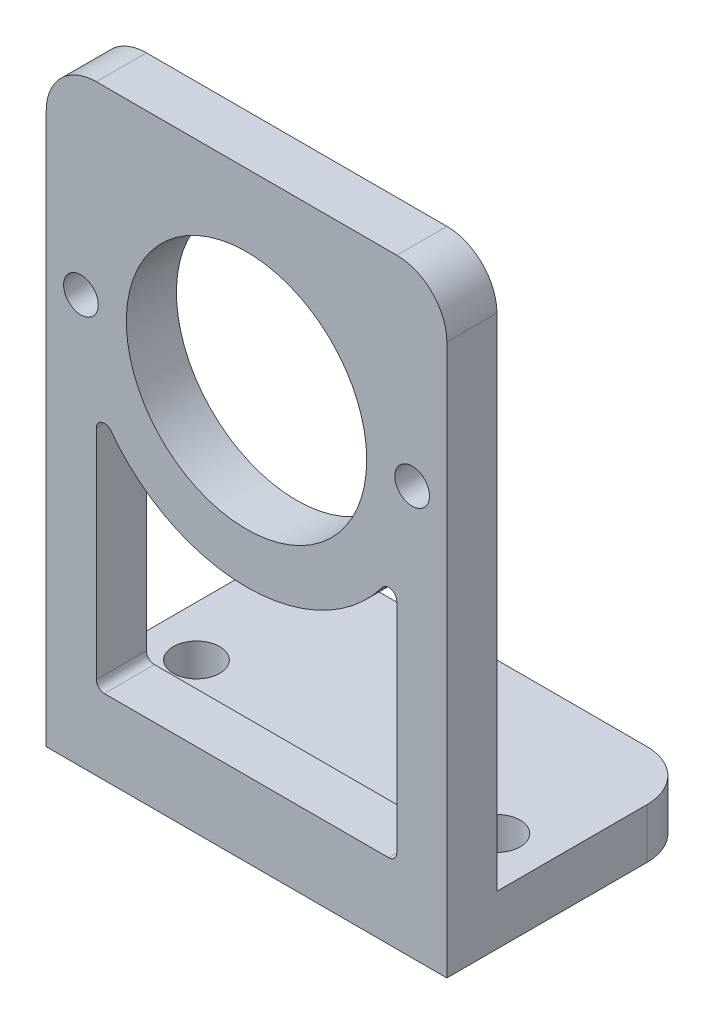
ISO-10303-21;
HEADER;
FILE_DESCRIPTION(('STEP AP214'),'2;1');
FILE_NAME('part.step','',(''),(''),'','','');
FILE_SCHEMA(('AUTOMOTIVE_DESIGN { 1 0 10303 214 1 1 1 1 }'));
ENDSEC;
DATA;
#1=APPLICATION_CONTEXT('core data for automotive mechanical design processes');
#2=APPLICATION_PROTOCOL_DEFINITION('international standard','automotive_design',2000,#1);
#3=PRODUCT_CONTEXT('',#1,'mechanical');
#4=PRODUCT('Part','Part','',(#3));
#5=PRODUCT_RELATED_PRODUCT_CATEGORY('part','',(#4));
#6=PRODUCT_DEFINITION_FORMATION('','',#4);
#7=PRODUCT_DEFINITION_CONTEXT('part definition',#1,'design');
#8=PRODUCT_DEFINITION('design','',#6,#7);
#9=PRODUCT_DEFINITION_SHAPE('','',#8);
#10=(LENGTH_UNIT() NAMED_UNIT(*) SI_UNIT(.MILLI.,.METRE.));
#11=(NAMED_UNIT(*) PLANE_ANGLE_UNIT() SI_UNIT($,.RADIAN.));
#12=(NAMED_UNIT(*) SI_UNIT($,.STERADIAN.) SOLID_ANGLE_UNIT());
#13=UNCERTAINTY_MEASURE_WITH_UNIT(LENGTH_MEASURE(1.E-05),#10,'distance_accuracy_value','');
#14=(GEOMETRIC_REPRESENTATION_CONTEXT(3) GLOBAL_UNCERTAINTY_ASSIGNED_CONTEXT((#13)) GLOBAL_UNIT_ASSIGNED_CONTEXT((#10,
#11,#12)) REPRESENTATION_CONTEXT('',''));
#15=CARTESIAN_POINT('',(0.,0.,0.));
#16=DIRECTION('',(0.,0.,1.));
#17=DIRECTION('',(1.,0.,0.));
#18=AXIS2_PLACEMENT_3D('',#15,#16,#17);
#19=CARTESIAN_POINT('',(12.7,38.1,-3.175));
#20=DIRECTION('',(0.,-1.,0.));
#21=DIRECTION('',(0.,0.,-1.));
#22=AXIS2_PLACEMENT_3D('',#19,#20,#21);
#23=PLANE('',#22);
#24=DIRECTION('',(-1.,0.,0.));
#25=VECTOR('',#24,1.);
#26=CARTESIAN_POINT('',(12.7,38.1,-3.175));
#27=LINE('',#26,#25);
#28=CARTESIAN_POINT('',(9.525,38.1,-3.175));
#29=VERTEX_POINT('',#28);
#30=CARTESIAN_POINT('',(-9.525,38.1,-3.175));
#31=VERTEX_POINT('',#30);
#32=EDGE_CURVE('E198',#29,#31,#27,.T.);
#33=ORIENTED_EDGE('',*,*,#32,.T.);
#34=DIRECTION('',(0.,0.,1.));
#35=VECTOR('',#34,1.);
#36=CARTESIAN_POINT('',(-9.525,38.1,-3.175));
#37=LINE('',#36,#35);
#38=CARTESIAN_POINT('',(-9.525,38.1,0.));
#39=VERTEX_POINT('',#38);
#40=EDGE_CURVE('E242',#31,#39,#37,.T.);
#41=ORIENTED_EDGE('',*,*,#40,.T.);
#42=DIRECTION('',(-1.,0.,0.));
#43=VECTOR('',#42,1.);
#44=CARTESIAN_POINT('',(12.7,38.1,0.));
#45=LINE('',#44,#43);
#46=CARTESIAN_POINT('',(9.525,38.1,0.));
#47=VERTEX_POINT('',#46);
#48=EDGE_CURVE('E184',#47,#39,#45,.T.);
#49=ORIENTED_EDGE('',*,*,#48,.F.);
#50=DIRECTION('',(0.,0.,1.));
#51=VECTOR('',#50,1.);
#52=CARTESIAN_POINT('',(9.525,38.1,-3.175));
#53=LINE('',#52,#51);
#54=EDGE_CURVE('E240',#47,#29,#53,.F.);
#55=ORIENTED_EDGE('',*,*,#54,.T.);
#56=EDGE_LOOP('',(#33,#41,#49,#55));
#57=FACE_BOUND('',#56,.T.);
#58=ADVANCED_FACE('F35',(#57),#23,.F.);
#59=CARTESIAN_POINT('',(12.7,38.1,0.));
#60=DIRECTION('',(0.,0.,-1.));
#61=DIRECTION('',(0.,1.,0.));
#62=AXIS2_PLACEMENT_3D('',#59,#60,#61);
#63=PLANE('',#62);
#64=DIRECTION('',(0.,-1.,0.));
#65=VECTOR('',#64,1.);
#66=CARTESIAN_POINT('',(-9.525,20.828,0.));
#67=LINE('',#66,#65);
#68=CARTESIAN_POINT('',(-9.525,19.0924648045806,0.));
#69=VERTEX_POINT('',#68);
#70=CARTESIAN_POINT('',(-9.525,5.2705,0.));
#71=VERTEX_POINT('',#70);
#72=EDGE_CURVE('E307',#69,#71,#67,.T.);
#73=ORIENTED_EDGE('',*,*,#72,.F.);
#74=CARTESIAN_POINT('',(-9.017,19.0924648045806,0.));
#75=DIRECTION('',(0.,0.,-1.));
#76=DIRECTION('',(0.,1.,0.));
#77=AXIS2_PLACEMENT_3D('',#74,#75,#76);
#78=CIRCLE('',#77,0.508);
#79=CARTESIAN_POINT('',(-8.6117415730337,19.3987809931388,0.));
#80=VERTEX_POINT('',#79);
#81=EDGE_CURVE('E43',#69,#80,#78,.T.);
#82=ORIENTED_EDGE('',*,*,#81,.T.);
#83=CARTESIAN_POINT('',(0.,25.908,0.));
#84=DIRECTION('',(0.,0.,-1.));
#85=DIRECTION('',(1.,0.,0.));
#86=AXIS2_PLACEMENT_3D('',#83,#84,#85);
#87=CIRCLE('',#86,10.795);
#88=CARTESIAN_POINT('',(8.61174157303371,19.3987809931388,0.));
#89=VERTEX_POINT('',#88);
#90=EDGE_CURVE('E305',#89,#80,#87,.T.);
#91=ORIENTED_EDGE('',*,*,#90,.F.);
#92=CARTESIAN_POINT('',(9.017,19.0924648045806,0.));
#93=DIRECTION('',(0.,0.,-1.));
#94=DIRECTION('',(0.,1.,0.));
#95=AXIS2_PLACEMENT_3D('',#92,#93,#94);
#96=CIRCLE('',#95,0.508);
#97=CARTESIAN_POINT('',(9.525,19.0924648045806,0.));
#98=VERTEX_POINT('',#97);
#99=EDGE_CURVE('E299',#89,#98,#96,.T.);
#100=ORIENTED_EDGE('',*,*,#99,.T.);
#101=DIRECTION('',(0.,1.,0.));
#102=VECTOR('',#101,1.);
#103=CARTESIAN_POINT('',(9.525,4.7625,0.));
#104=LINE('',#103,#102);
#105=CARTESIAN_POINT('',(9.525,5.2705,0.));
#106=VERTEX_POINT('',#105);
#107=EDGE_CURVE('E341',#106,#98,#104,.T.);
#108=ORIENTED_EDGE('',*,*,#107,.F.);
#109=CARTESIAN_POINT('',(9.017,5.2705,0.));
#110=DIRECTION('',(0.,0.,-1.));
#111=DIRECTION('',(0.,1.,0.));
#112=AXIS2_PLACEMENT_3D('',#109,#110,#111);
#113=CIRCLE('',#112,0.508);
#114=CARTESIAN_POINT('',(9.017,4.7625,0.));
#115=VERTEX_POINT('',#114);
#116=EDGE_CURVE('E295',#106,#115,#113,.T.);
#117=ORIENTED_EDGE('',*,*,#116,.T.);
#118=DIRECTION('',(1.,0.,0.));
#119=VECTOR('',#118,1.);
#120=CARTESIAN_POINT('',(-9.525,4.7625,0.));
#121=LINE('',#120,#119);
#122=CARTESIAN_POINT('',(-9.017,4.7625,0.));
#123=VERTEX_POINT('',#122);
#124=EDGE_CURVE('E331',#123,#115,#121,.T.);
#125=ORIENTED_EDGE('',*,*,#124,.F.);
#126=CARTESIAN_POINT('',(-9.017,5.2705,0.));
#127=DIRECTION('',(0.,0.,-1.));
#128=DIRECTION('',(0.,1.,0.));
#129=AXIS2_PLACEMENT_3D('',#126,#127,#128);
#130=CIRCLE('',#129,0.508);
#131=EDGE_CURVE('E291',#123,#71,#130,.T.);
#132=ORIENTED_EDGE('',*,*,#131,.T.);
#133=EDGE_LOOP('',(#73,#82,#91,#100,#108,#117,#125,#132));
#134=FACE_BOUND('',#133,.T.);
#135=CARTESIAN_POINT('',(10.5,25.908,0.));
#136=DIRECTION('',(0.,0.,1.));
#137=DIRECTION('',(1.,0.,0.));
#138=AXIS2_PLACEMENT_3D('',#135,#136,#137);
#139=CIRCLE('',#138,1.1);
#140=CARTESIAN_POINT('',(11.6,25.908,0.));
#141=VERTEX_POINT('',#140);
#142=EDGE_CURVE('E262',#141,#141,#139,.T.);
#143=ORIENTED_EDGE('',*,*,#142,.F.);
#144=EDGE_LOOP('',(#143));
#145=FACE_BOUND('',#144,.T.);
#146=CARTESIAN_POINT('',(-10.5,25.908,0.));
#147=DIRECTION('',(0.,0.,1.));
#148=DIRECTION('',(1.,0.,0.));
#149=AXIS2_PLACEMENT_3D('',#146,#147,#148);
#150=CIRCLE('',#149,1.1);
#151=CARTESIAN_POINT('',(-9.40000000000002,25.908,0.));
#152=VERTEX_POINT('',#151);
#153=EDGE_CURVE('E258',#152,#152,#150,.T.);
#154=ORIENTED_EDGE('',*,*,#153,.F.);
#155=EDGE_LOOP('',(#154));
#156=FACE_BOUND('',#155,.T.);
#157=CARTESIAN_POINT('',(0.,25.908,0.));
#158=DIRECTION('',(0.,0.,1.));
#159=DIRECTION('',(1.,0.,0.));
#160=AXIS2_PLACEMENT_3D('',#157,#158,#159);
#161=CIRCLE('',#160,7.62);
#162=CARTESIAN_POINT('',(7.62,25.908,0.));
#163=VERTEX_POINT('',#162);
#164=EDGE_CURVE('E221',#163,#163,#161,.T.);
#165=ORIENTED_EDGE('',*,*,#164,.F.);
#166=EDGE_LOOP('',(#165));
#167=FACE_BOUND('',#166,.T.);
#168=ORIENTED_EDGE('',*,*,#48,.T.);
#169=CARTESIAN_POINT('',(-9.525,34.925,0.));
#170=DIRECTION('',(0.,0.,-1.));
#171=DIRECTION('',(0.,1.,0.));
#172=AXIS2_PLACEMENT_3D('',#169,#170,#171);
#173=CIRCLE('',#172,3.175);
#174=CARTESIAN_POINT('',(-12.7,34.925,0.));
#175=VERTEX_POINT('',#174);
#176=EDGE_CURVE('E247',#39,#175,#173,.F.);
#177=ORIENTED_EDGE('',*,*,#176,.T.);
#178=DIRECTION('',(0.,-1.,0.));
#179=VECTOR('',#178,1.);
#180=CARTESIAN_POINT('',(-12.7,38.1,0.));
#181=LINE('',#180,#179);
#182=CARTESIAN_POINT('',(-12.7,0.,0.));
#183=VERTEX_POINT('',#182);
#184=EDGE_CURVE('E180',#175,#183,#181,.T.);
#185=ORIENTED_EDGE('',*,*,#184,.T.);
#186=DIRECTION('',(-1.,0.,0.));
#187=VECTOR('',#186,1.);
#188=CARTESIAN_POINT('',(12.7,0.,0.));
#189=LINE('',#188,#187);
#190=CARTESIAN_POINT('',(12.7,0.,0.));
#191=VERTEX_POINT('',#190);
#192=EDGE_CURVE('E176',#191,#183,#189,.T.);
#193=ORIENTED_EDGE('',*,*,#192,.F.);
#194=DIRECTION('',(0.,-1.,0.));
#195=VECTOR('',#194,1.);
#196=CARTESIAN_POINT('',(12.7,38.1,0.));
#197=LINE('',#196,#195);
#198=CARTESIAN_POINT('',(12.7,34.925,0.));
#199=VERTEX_POINT('',#198);
#200=EDGE_CURVE('E162',#199,#191,#197,.T.);
#201=ORIENTED_EDGE('',*,*,#200,.F.);
#202=CARTESIAN_POINT('',(9.525,34.925,0.));
#203=DIRECTION('',(0.,0.,-1.));
#204=DIRECTION('',(0.,1.,0.));
#205=AXIS2_PLACEMENT_3D('',#202,#203,#204);
#206=CIRCLE('',#205,3.175);
#207=EDGE_CURVE('E245',#199,#47,#206,.F.);
#208=ORIENTED_EDGE('',*,*,#207,.T.);
#209=EDGE_LOOP('',(#168,#177,#185,#193,#201,#208));
#210=FACE_BOUND('',#209,.T.);
#211=ADVANCED_FACE('F178',(#134,#145,#156,#167,#210),#63,.F.);
#212=CARTESIAN_POINT('',(12.7,0.,0.));
#213=DIRECTION('',(0.,1.,0.));
#214=DIRECTION('',(0.,0.,1.));
#215=AXIS2_PLACEMENT_3D('',#212,#213,#214);
#216=PLANE('',#215);
#217=CARTESIAN_POINT('',(-9.525,0.,-6.35));
#218=DIRECTION('',(0.,1.,0.));
#219=DIRECTION('',(0.,0.,1.));
#220=AXIS2_PLACEMENT_3D('',#217,#218,#219);
#221=CIRCLE('',#220,1.47319999999999);
#222=CARTESIAN_POINT('',(-9.525,0.,-4.87680000000001));
#223=VERTEX_POINT('',#222);
#224=EDGE_CURVE('E354',#223,#223,#221,.T.);
#225=ORIENTED_EDGE('',*,*,#224,.T.);
#226=EDGE_LOOP('',(#225));
#227=FACE_BOUND('',#226,.T.);
#228=CARTESIAN_POINT('',(0.,0.,-12.7));
#229=DIRECTION('',(0.,1.,0.));
#230=DIRECTION('',(0.,0.,1.));
#231=AXIS2_PLACEMENT_3D('',#228,#229,#230);
#232=CIRCLE('',#231,1.47319999999999);
#233=CARTESIAN_POINT('',(0.,0.,-11.2268));
#234=VERTEX_POINT('',#233);
#235=EDGE_CURVE('E360',#234,#234,#232,.T.);
#236=ORIENTED_EDGE('',*,*,#235,.T.);
#237=EDGE_LOOP('',(#236));
#238=FACE_BOUND('',#237,.T.);
#239=CARTESIAN_POINT('',(9.525,0.,-6.35));
#240=DIRECTION('',(0.,1.,0.));
#241=DIRECTION('',(0.,0.,1.));
#242=AXIS2_PLACEMENT_3D('',#239,#240,#241);
#243=CIRCLE('',#242,1.47319999999999);
#244=CARTESIAN_POINT('',(9.525,0.,-4.87680000000001));
#245=VERTEX_POINT('',#244);
#246=EDGE_CURVE('E366',#245,#245,#243,.T.);
#247=ORIENTED_EDGE('',*,*,#246,.T.);
#248=EDGE_LOOP('',(#247));
#249=FACE_BOUND('',#248,.T.);
#250=DIRECTION('',(0.,0.,-1.));
#251=VECTOR('',#250,1.);
#252=CARTESIAN_POINT('',(-12.7,0.,0.));
#253=LINE('',#252,#251);
#254=CARTESIAN_POINT('',(-12.7,0.,-12.7));
#255=VERTEX_POINT('',#254);
#256=EDGE_CURVE('E200',#183,#255,#253,.T.);
#257=ORIENTED_EDGE('',*,*,#256,.T.);
#258=CARTESIAN_POINT('',(-9.525,0.,-12.7));
#259=DIRECTION('',(0.,1.,0.));
#260=DIRECTION('',(0.,0.,1.));
#261=AXIS2_PLACEMENT_3D('',#258,#259,#260);
#262=CIRCLE('',#261,3.175);
#263=CARTESIAN_POINT('',(-9.525,0.,-15.875));
#264=VERTEX_POINT('',#263);
#265=EDGE_CURVE('E235',#255,#264,#262,.F.);
#266=ORIENTED_EDGE('',*,*,#265,.T.);
#267=DIRECTION('',(-1.,0.,0.));
#268=VECTOR('',#267,1.);
#269=CARTESIAN_POINT('',(12.7,0.,-15.875));
#270=LINE('',#269,#268);
#271=CARTESIAN_POINT('',(9.525,0.,-15.875));
#272=VERTEX_POINT('',#271);
#273=EDGE_CURVE('E185',#272,#264,#270,.T.);
#274=ORIENTED_EDGE('',*,*,#273,.F.);
#275=CARTESIAN_POINT('',(9.525,0.,-12.7));
#276=DIRECTION('',(0.,1.,0.));
#277=DIRECTION('',(0.,0.,1.));
#278=AXIS2_PLACEMENT_3D('',#275,#276,#277);
#279=CIRCLE('',#278,3.175);
#280=CARTESIAN_POINT('',(12.7,0.,-12.7));
#281=VERTEX_POINT('',#280);
#282=EDGE_CURVE('E190',#272,#281,#279,.F.);
#283=ORIENTED_EDGE('',*,*,#282,.T.);
#284=DIRECTION('',(0.,0.,-1.));
#285=VECTOR('',#284,1.);
#286=CARTESIAN_POINT('',(12.7,0.,0.));
#287=LINE('',#286,#285);
#288=EDGE_CURVE('E167',#191,#281,#287,.T.);
#289=ORIENTED_EDGE('',*,*,#288,.F.);
#290=ORIENTED_EDGE('',*,*,#192,.T.);
#291=EDGE_LOOP('',(#257,#266,#274,#283,#289,#290));
#292=FACE_BOUND('',#291,.T.);
#293=ADVANCED_FACE('F187',(#227,#238,#249,#292),#216,.F.);
#294=CARTESIAN_POINT('',(12.7,0.,-15.875));
#295=DIRECTION('',(0.,0.,1.));
#296=DIRECTION('',(1.,0.,0.));
#297=AXIS2_PLACEMENT_3D('',#294,#295,#296);
#298=PLANE('',#297);
#299=ORIENTED_EDGE('',*,*,#273,.T.);
#300=DIRECTION('',(0.,1.,0.));
#301=VECTOR('',#300,1.);
#302=CARTESIAN_POINT('',(-9.525,0.,-15.875));
#303=LINE('',#302,#301);
#304=CARTESIAN_POINT('',(-9.525,3.175,-15.875));
#305=VERTEX_POINT('',#304);
#306=EDGE_CURVE('E223',#264,#305,#303,.T.);
#307=ORIENTED_EDGE('',*,*,#306,.T.);
#308=DIRECTION('',(-1.,0.,0.));
#309=VECTOR('',#308,1.);
#310=CARTESIAN_POINT('',(12.7,3.175,-15.875));
#311=LINE('',#310,#309);
#312=CARTESIAN_POINT('',(9.525,3.175,-15.875));
#313=VERTEX_POINT('',#312);
#314=EDGE_CURVE('E212',#313,#305,#311,.T.);
#315=ORIENTED_EDGE('',*,*,#314,.F.);
#316=DIRECTION('',(0.,1.,0.));
#317=VECTOR('',#316,1.);
#318=CARTESIAN_POINT('',(9.525,0.,-15.875));
#319=LINE('',#318,#317);
#320=EDGE_CURVE('E218',#313,#272,#319,.F.);
#321=ORIENTED_EDGE('',*,*,#320,.T.);
#322=EDGE_LOOP('',(#299,#307,#315,#321));
#323=FACE_BOUND('',#322,.T.);
#324=ADVANCED_FACE('F380',(#323),#298,.F.);
#325=CARTESIAN_POINT('',(12.7,3.175,-15.875));
#326=DIRECTION('',(0.,-1.,0.));
#327=DIRECTION('',(0.,0.,-1.));
#328=AXIS2_PLACEMENT_3D('',#325,#326,#327);
#329=PLANE('',#328);
#330=CARTESIAN_POINT('',(-9.525,3.175,-6.35));
#331=DIRECTION('',(0.,1.,0.));
#332=DIRECTION('',(0.,0.,1.));
#333=AXIS2_PLACEMENT_3D('',#330,#331,#332);
#334=CIRCLE('',#333,1.47319999999999);
#335=CARTESIAN_POINT('',(-9.525,3.175,-4.87680000000001));
#336=VERTEX_POINT('',#335);
#337=EDGE_CURVE('E257',#336,#336,#334,.T.);
#338=ORIENTED_EDGE('',*,*,#337,.F.);
#339=EDGE_LOOP('',(#338));
#340=FACE_BOUND('',#339,.T.);
#341=CARTESIAN_POINT('',(0.,3.175,-12.7));
#342=DIRECTION('',(0.,1.,0.));
#343=DIRECTION('',(0.,0.,1.));
#344=AXIS2_PLACEMENT_3D('',#341,#342,#343);
#345=CIRCLE('',#344,1.47319999999999);
#346=CARTESIAN_POINT('',(0.,3.175,-11.2268));
#347=VERTEX_POINT('',#346);
#348=EDGE_CURVE('E357',#347,#347,#345,.T.);
#349=ORIENTED_EDGE('',*,*,#348,.F.);
#350=EDGE_LOOP('',(#349));
#351=FACE_BOUND('',#350,.T.);
#352=CARTESIAN_POINT('',(9.525,3.175,-6.35));
#353=DIRECTION('',(0.,1.,0.));
#354=DIRECTION('',(0.,0.,1.));
#355=AXIS2_PLACEMENT_3D('',#352,#353,#354);
#356=CIRCLE('',#355,1.47319999999999);
#357=CARTESIAN_POINT('',(9.525,3.175,-4.87680000000001));
#358=VERTEX_POINT('',#357);
#359=EDGE_CURVE('E363',#358,#358,#356,.T.);
#360=ORIENTED_EDGE('',*,*,#359,.F.);
#361=EDGE_LOOP('',(#360));
#362=FACE_BOUND('',#361,.T.);
#363=ORIENTED_EDGE('',*,*,#314,.T.);
#364=CARTESIAN_POINT('',(-9.525,3.175,-12.7));
#365=DIRECTION('',(0.,-1.,0.));
#366=DIRECTION('',(0.,0.,-1.));
#367=AXIS2_PLACEMENT_3D('',#364,#365,#366);
#368=CIRCLE('',#367,3.175);
#369=CARTESIAN_POINT('',(-12.7,3.175,-12.7));
#370=VERTEX_POINT('',#369);
#371=EDGE_CURVE('E228',#305,#370,#368,.F.);
#372=ORIENTED_EDGE('',*,*,#371,.T.);
#373=DIRECTION('',(0.,0.,1.));
#374=VECTOR('',#373,1.);
#375=CARTESIAN_POINT('',(-12.7,3.175,-15.875));
#376=LINE('',#375,#374);
#377=CARTESIAN_POINT('',(-12.7,3.175,-3.175));
#378=VERTEX_POINT('',#377);
#379=EDGE_CURVE('E203',#370,#378,#376,.T.);
#380=ORIENTED_EDGE('',*,*,#379,.T.);
#381=DIRECTION('',(-1.,0.,0.));
#382=VECTOR('',#381,1.);
#383=CARTESIAN_POINT('',(12.7,3.175,-3.175));
#384=LINE('',#383,#382);
#385=CARTESIAN_POINT('',(12.7,3.175,-3.175));
#386=VERTEX_POINT('',#385);
#387=EDGE_CURVE('E209',#386,#378,#384,.T.);
#388=ORIENTED_EDGE('',*,*,#387,.F.);
#389=DIRECTION('',(0.,0.,1.));
#390=VECTOR('',#389,1.);
#391=CARTESIAN_POINT('',(12.7,3.175,-15.875));
#392=LINE('',#391,#390);
#393=CARTESIAN_POINT('',(12.7,3.175,-12.7));
#394=VERTEX_POINT('',#393);
#395=EDGE_CURVE('E191',#394,#386,#392,.T.);
#396=ORIENTED_EDGE('',*,*,#395,.F.);
#397=CARTESIAN_POINT('',(9.525,3.175,-12.7));
#398=DIRECTION('',(0.,-1.,0.));
#399=DIRECTION('',(0.,0.,-1.));
#400=AXIS2_PLACEMENT_3D('',#397,#398,#399);
#401=CIRCLE('',#400,3.175);
#402=EDGE_CURVE('E226',#394,#313,#401,.F.);
#403=ORIENTED_EDGE('',*,*,#402,.T.);
#404=EDGE_LOOP('',(#363,#372,#380,#388,#396,#403));
#405=FACE_BOUND('',#404,.T.);
#406=ADVANCED_FACE('F472',(#340,#351,#362,#405),#329,.F.);
#407=CARTESIAN_POINT('',(12.7,3.175,-3.175));
#408=DIRECTION('',(0.,0.,1.));
#409=DIRECTION('',(0.,-1.,0.));
#410=AXIS2_PLACEMENT_3D('',#407,#408,#409);
#411=PLANE('',#410);
#412=DIRECTION('',(1.,0.,0.));
#413=VECTOR('',#412,1.);
#414=CARTESIAN_POINT('',(12.7,4.7625,-3.175));
#415=LINE('',#414,#413);
#416=CARTESIAN_POINT('',(-9.01699999999999,4.7625,-3.175));
#417=VERTEX_POINT('',#416);
#418=CARTESIAN_POINT('',(9.017,4.7625,-3.175));
#419=VERTEX_POINT('',#418);
#420=EDGE_CURVE('E265',#417,#419,#415,.T.);
#421=ORIENTED_EDGE('',*,*,#420,.T.);
#422=CARTESIAN_POINT('',(9.017,5.2705,-3.175));
#423=DIRECTION('',(0.,0.,1.));
#424=DIRECTION('',(0.,-1.,0.));
#425=AXIS2_PLACEMENT_3D('',#422,#423,#424);
#426=CIRCLE('',#425,0.508);
#427=CARTESIAN_POINT('',(9.525,5.2705,-3.175));
#428=VERTEX_POINT('',#427);
#429=EDGE_CURVE('E297',#419,#428,#426,.T.);
#430=ORIENTED_EDGE('',*,*,#429,.T.);
#431=DIRECTION('',(0.,1.,0.));
#432=VECTOR('',#431,1.);
#433=CARTESIAN_POINT('',(9.525,3.175,-3.175));
#434=LINE('',#433,#432);
#435=CARTESIAN_POINT('',(9.525,19.0924648045806,-3.175));
#436=VERTEX_POINT('',#435);
#437=EDGE_CURVE('E268',#428,#436,#434,.T.);
#438=ORIENTED_EDGE('',*,*,#437,.T.);
#439=CARTESIAN_POINT('',(9.017,19.0924648045806,-3.175));
#440=DIRECTION('',(0.,0.,1.));
#441=DIRECTION('',(0.,-1.,0.));
#442=AXIS2_PLACEMENT_3D('',#439,#440,#441);
#443=CIRCLE('',#442,0.508);
#444=CARTESIAN_POINT('',(8.61174157303371,19.3987809931388,-3.175));
#445=VERTEX_POINT('',#444);
#446=EDGE_CURVE('E57',#436,#445,#443,.T.);
#447=ORIENTED_EDGE('',*,*,#446,.T.);
#448=CARTESIAN_POINT('',(0.,25.908,-3.175));
#449=DIRECTION('',(0.,0.,1.));
#450=DIRECTION('',(0.,-1.,0.));
#451=AXIS2_PLACEMENT_3D('',#448,#449,#450);
#452=CIRCLE('',#451,10.795);
#453=CARTESIAN_POINT('',(-8.6117415730337,19.3987809931388,-3.175));
#454=VERTEX_POINT('',#453);
#455=EDGE_CURVE('E270',#445,#454,#452,.F.);
#456=ORIENTED_EDGE('',*,*,#455,.T.);
#457=CARTESIAN_POINT('',(-9.017,19.0924648045806,-3.175));
#458=DIRECTION('',(0.,0.,1.));
#459=DIRECTION('',(0.,-1.,0.));
#460=AXIS2_PLACEMENT_3D('',#457,#458,#459);
#461=CIRCLE('',#460,0.508);
#462=CARTESIAN_POINT('',(-9.52499999999999,19.0924648045806,-3.175));
#463=VERTEX_POINT('',#462);
#464=EDGE_CURVE('E11',#454,#463,#461,.T.);
#465=ORIENTED_EDGE('',*,*,#464,.T.);
#466=DIRECTION('',(0.,-1.,0.));
#467=VECTOR('',#466,1.);
#468=CARTESIAN_POINT('',(-9.52499999999999,3.175,-3.175));
#469=LINE('',#468,#467);
#470=CARTESIAN_POINT('',(-9.52499999999999,5.2705,-3.175));
#471=VERTEX_POINT('',#470);
#472=EDGE_CURVE('E253',#463,#471,#469,.T.);
#473=ORIENTED_EDGE('',*,*,#472,.T.);
#474=CARTESIAN_POINT('',(-9.017,5.2705,-3.175));
#475=DIRECTION('',(0.,0.,1.));
#476=DIRECTION('',(0.,-1.,0.));
#477=AXIS2_PLACEMENT_3D('',#474,#475,#476);
#478=CIRCLE('',#477,0.508);
#479=EDGE_CURVE('E293',#471,#417,#478,.T.);
#480=ORIENTED_EDGE('',*,*,#479,.T.);
#481=EDGE_LOOP('',(#421,#430,#438,#447,#456,#465,#473,#480));
#482=FACE_BOUND('',#481,.T.);
#483=CARTESIAN_POINT('',(10.5,25.908,-3.175));
#484=DIRECTION('',(0.,0.,1.));
#485=DIRECTION('',(0.,-1.,0.));
#486=AXIS2_PLACEMENT_3D('',#483,#484,#485);
#487=CIRCLE('',#486,1.1);
#488=CARTESIAN_POINT('',(10.5,24.808,-3.175));
#489=VERTEX_POINT('',#488);
#490=EDGE_CURVE('E259',#489,#489,#487,.T.);
#491=ORIENTED_EDGE('',*,*,#490,.T.);
#492=EDGE_LOOP('',(#491));
#493=FACE_BOUND('',#492,.T.);
#494=CARTESIAN_POINT('',(-10.5,25.908,-3.175));
#495=DIRECTION('',(0.,0.,1.));
#496=DIRECTION('',(0.,-1.,0.));
#497=AXIS2_PLACEMENT_3D('',#494,#495,#496);
#498=CIRCLE('',#497,1.1);
#499=CARTESIAN_POINT('',(-10.5,24.808,-3.175));
#500=VERTEX_POINT('',#499);
#501=EDGE_CURVE('E254',#500,#500,#498,.T.);
#502=ORIENTED_EDGE('',*,*,#501,.T.);
#503=EDGE_LOOP('',(#502));
#504=FACE_BOUND('',#503,.T.);
#505=CARTESIAN_POINT('',(0.,25.908,-3.175));
#506=DIRECTION('',(0.,0.,1.));
#507=DIRECTION('',(0.,-1.,0.));
#508=AXIS2_PLACEMENT_3D('',#505,#506,#507);
#509=CIRCLE('',#508,7.62);
#510=CARTESIAN_POINT('',(0.,18.288,-3.175));
#511=VERTEX_POINT('',#510);
#512=EDGE_CURVE('E201',#511,#511,#509,.T.);
#513=ORIENTED_EDGE('',*,*,#512,.T.);
#514=EDGE_LOOP('',(#513));
#515=FACE_BOUND('',#514,.T.);
#516=DIRECTION('',(0.,1.,0.));
#517=VECTOR('',#516,1.);
#518=CARTESIAN_POINT('',(-12.7,3.175,-3.175));
#519=LINE('',#518,#517);
#520=CARTESIAN_POINT('',(-12.7,34.925,-3.175));
#521=VERTEX_POINT('',#520);
#522=EDGE_CURVE('E173',#378,#521,#519,.T.);
#523=ORIENTED_EDGE('',*,*,#522,.T.);
#524=CARTESIAN_POINT('',(-9.525,34.925,-3.175));
#525=DIRECTION('',(0.,0.,1.));
#526=DIRECTION('',(0.,-1.,0.));
#527=AXIS2_PLACEMENT_3D('',#524,#525,#526);
#528=CIRCLE('',#527,3.175);
#529=EDGE_CURVE('E251',#521,#31,#528,.F.);
#530=ORIENTED_EDGE('',*,*,#529,.T.);
#531=ORIENTED_EDGE('',*,*,#32,.F.);
#532=CARTESIAN_POINT('',(9.525,34.925,-3.175));
#533=DIRECTION('',(0.,0.,1.));
#534=DIRECTION('',(0.,-1.,0.));
#535=AXIS2_PLACEMENT_3D('',#532,#533,#534);
#536=CIRCLE('',#535,3.175);
#537=CARTESIAN_POINT('',(12.7,34.925,-3.175));
#538=VERTEX_POINT('',#537);
#539=EDGE_CURVE('E249',#29,#538,#536,.F.);
#540=ORIENTED_EDGE('',*,*,#539,.T.);
#541=DIRECTION('',(0.,1.,0.));
#542=VECTOR('',#541,1.);
#543=CARTESIAN_POINT('',(12.7,3.175,-3.175));
#544=LINE('',#543,#542);
#545=EDGE_CURVE('E193',#386,#538,#544,.T.);
#546=ORIENTED_EDGE('',*,*,#545,.F.);
#547=ORIENTED_EDGE('',*,*,#387,.T.);
#548=EDGE_LOOP('',(#523,#530,#531,#540,#546,#547));
#549=FACE_BOUND('',#548,.T.);
#550=ADVANCED_FACE('F315',(#482,#493,#504,#515,#549),#411,.F.);
#551=CARTESIAN_POINT('',(12.7,0.,0.));
#552=DIRECTION('',(1.,0.,0.));
#553=DIRECTION('',(0.,0.,-1.));
#554=AXIS2_PLACEMENT_3D('',#551,#552,#553);
#555=PLANE('',#554);
#556=ORIENTED_EDGE('',*,*,#288,.T.);
#557=DIRECTION('',(0.,1.,0.));
#558=VECTOR('',#557,1.);
#559=CARTESIAN_POINT('',(12.7,3.175,-12.7));
#560=LINE('',#559,#558);
#561=EDGE_CURVE('E238',#281,#394,#560,.T.);
#562=ORIENTED_EDGE('',*,*,#561,.T.);
#563=ORIENTED_EDGE('',*,*,#395,.T.);
#564=ORIENTED_EDGE('',*,*,#545,.T.);
#565=DIRECTION('',(0.,0.,1.));
#566=VECTOR('',#565,1.);
#567=CARTESIAN_POINT('',(12.7,34.925,0.));
#568=LINE('',#567,#566);
#569=EDGE_CURVE('E171',#538,#199,#568,.T.);
#570=ORIENTED_EDGE('',*,*,#569,.T.);
#571=ORIENTED_EDGE('',*,*,#200,.T.);
#572=EDGE_LOOP('',(#556,#562,#563,#564,#570,#571));
#573=FACE_BOUND('',#572,.T.);
#574=ADVANCED_FACE('F164',(#573),#555,.T.);
#575=CARTESIAN_POINT('',(-12.7,0.,0.));
#576=DIRECTION('',(1.,0.,0.));
#577=DIRECTION('',(0.,0.,-1.));
#578=AXIS2_PLACEMENT_3D('',#575,#576,#577);
#579=PLANE('',#578);
#580=ORIENTED_EDGE('',*,*,#379,.F.);
#581=DIRECTION('',(0.,1.,0.));
#582=VECTOR('',#581,1.);
#583=CARTESIAN_POINT('',(-12.7,0.,-12.7));
#584=LINE('',#583,#582);
#585=EDGE_CURVE('E232',#370,#255,#584,.F.);
#586=ORIENTED_EDGE('',*,*,#585,.T.);
#587=ORIENTED_EDGE('',*,*,#256,.F.);
#588=ORIENTED_EDGE('',*,*,#184,.F.);
#589=DIRECTION('',(0.,0.,1.));
#590=VECTOR('',#589,1.);
#591=CARTESIAN_POINT('',(-12.7,34.925,0.));
#592=LINE('',#591,#590);
#593=EDGE_CURVE('E230',#175,#521,#592,.F.);
#594=ORIENTED_EDGE('',*,*,#593,.T.);
#595=ORIENTED_EDGE('',*,*,#522,.F.);
#596=EDGE_LOOP('',(#580,#586,#587,#588,#594,#595));
#597=FACE_BOUND('',#596,.T.);
#598=ADVANCED_FACE('F574',(#597),#579,.F.);
#599=CARTESIAN_POINT('',(0.,25.908,-15.875));
#600=DIRECTION('',(0.,0.,1.));
#601=DIRECTION('',(1.,0.,0.));
#602=AXIS2_PLACEMENT_3D('',#599,#600,#601);
#603=CYLINDRICAL_SURFACE('',#602,7.62);
#604=ORIENTED_EDGE('',*,*,#164,.T.);
#605=EDGE_LOOP('',(#604));
#606=FACE_BOUND('',#605,.T.);
#607=ORIENTED_EDGE('',*,*,#512,.F.);
#608=EDGE_LOOP('',(#607));
#609=FACE_BOUND('',#608,.T.);
#610=ADVANCED_FACE('F371',(#606,#609),#603,.F.);
#611=CARTESIAN_POINT('',(-9.525,0.,-12.7));
#612=DIRECTION('',(0.,1.,0.));
#613=DIRECTION('',(0.,0.,1.));
#614=AXIS2_PLACEMENT_3D('',#611,#612,#613);
#615=CYLINDRICAL_SURFACE('',#614,3.175);
#616=ORIENTED_EDGE('',*,*,#265,.F.);
#617=ORIENTED_EDGE('',*,*,#585,.F.);
#618=ORIENTED_EDGE('',*,*,#371,.F.);
#619=ORIENTED_EDGE('',*,*,#306,.F.);
#620=EDGE_LOOP('',(#616,#617,#618,#619));
#621=FACE_BOUND('',#620,.T.);
#622=ADVANCED_FACE('F387',(#621),#615,.T.);
#623=CARTESIAN_POINT('',(9.525,0.,-12.7));
#624=DIRECTION('',(0.,-1.,0.));
#625=DIRECTION('',(0.,0.,-1.));
#626=AXIS2_PLACEMENT_3D('',#623,#624,#625);
#627=CYLINDRICAL_SURFACE('',#626,3.175);
#628=ORIENTED_EDGE('',*,*,#282,.F.);
#629=ORIENTED_EDGE('',*,*,#320,.F.);
#630=ORIENTED_EDGE('',*,*,#402,.F.);
#631=ORIENTED_EDGE('',*,*,#561,.F.);
#632=EDGE_LOOP('',(#628,#629,#630,#631));
#633=FACE_BOUND('',#632,.T.);
#634=ADVANCED_FACE('F390',(#633),#627,.T.);
#635=CARTESIAN_POINT('',(-9.525,34.925,-3.175));
#636=DIRECTION('',(0.,0.,1.));
#637=DIRECTION('',(1.,0.,0.));
#638=AXIS2_PLACEMENT_3D('',#635,#636,#637);
#639=CYLINDRICAL_SURFACE('',#638,3.175);
#640=ORIENTED_EDGE('',*,*,#529,.F.);
#641=ORIENTED_EDGE('',*,*,#593,.F.);
#642=ORIENTED_EDGE('',*,*,#176,.F.);
#643=ORIENTED_EDGE('',*,*,#40,.F.);
#644=EDGE_LOOP('',(#640,#641,#642,#643));
#645=FACE_BOUND('',#644,.T.);
#646=ADVANCED_FACE('F394',(#645),#639,.T.);
#647=CARTESIAN_POINT('',(9.525,34.925,0.));
#648=DIRECTION('',(0.,0.,-1.));
#649=DIRECTION('',(-1.,0.,0.));
#650=AXIS2_PLACEMENT_3D('',#647,#648,#649);
#651=CYLINDRICAL_SURFACE('',#650,3.175);
#652=ORIENTED_EDGE('',*,*,#539,.F.);
#653=ORIENTED_EDGE('',*,*,#54,.F.);
#654=ORIENTED_EDGE('',*,*,#207,.F.);
#655=ORIENTED_EDGE('',*,*,#569,.F.);
#656=EDGE_LOOP('',(#652,#653,#654,#655));
#657=FACE_BOUND('',#656,.T.);
#658=ADVANCED_FACE('F398',(#657),#651,.T.);
#659=CARTESIAN_POINT('',(9.525,3.175,-6.35));
#660=DIRECTION('',(0.,1.,0.));
#661=DIRECTION('',(0.,0.,1.));
#662=AXIS2_PLACEMENT_3D('',#659,#660,#661);
#663=CYLINDRICAL_SURFACE('',#662,1.47319999999999);
#664=ORIENTED_EDGE('',*,*,#246,.F.);
#665=EDGE_LOOP('',(#664));
#666=FACE_BOUND('',#665,.T.);
#667=ORIENTED_EDGE('',*,*,#359,.T.);
#668=EDGE_LOOP('',(#667));
#669=FACE_BOUND('',#668,.T.);
#670=ADVANCED_FACE('F402',(#666,#669),#663,.F.);
#671=CARTESIAN_POINT('',(0.,3.175,-12.7));
#672=DIRECTION('',(0.,1.,0.));
#673=DIRECTION('',(0.,0.,1.));
#674=AXIS2_PLACEMENT_3D('',#671,#672,#673);
#675=CYLINDRICAL_SURFACE('',#674,1.47319999999999);
#676=ORIENTED_EDGE('',*,*,#235,.F.);
#677=EDGE_LOOP('',(#676));
#678=FACE_BOUND('',#677,.T.);
#679=ORIENTED_EDGE('',*,*,#348,.T.);
#680=EDGE_LOOP('',(#679));
#681=FACE_BOUND('',#680,.T.);
#682=ADVANCED_FACE('F510',(#678,#681),#675,.F.);
#683=CARTESIAN_POINT('',(-9.525,3.175,-6.35));
#684=DIRECTION('',(0.,1.,0.));
#685=DIRECTION('',(0.,0.,1.));
#686=AXIS2_PLACEMENT_3D('',#683,#684,#685);
#687=CYLINDRICAL_SURFACE('',#686,1.47319999999999);
#688=ORIENTED_EDGE('',*,*,#224,.F.);
#689=EDGE_LOOP('',(#688));
#690=FACE_BOUND('',#689,.T.);
#691=ORIENTED_EDGE('',*,*,#337,.T.);
#692=EDGE_LOOP('',(#691));
#693=FACE_BOUND('',#692,.T.);
#694=ADVANCED_FACE('F500',(#690,#693),#687,.F.);
#695=CARTESIAN_POINT('',(-10.5,25.908,0.));
#696=DIRECTION('',(0.,0.,1.));
#697=DIRECTION('',(1.,0.,0.));
#698=AXIS2_PLACEMENT_3D('',#695,#696,#697);
#699=CYLINDRICAL_SURFACE('',#698,1.1);
#700=ORIENTED_EDGE('',*,*,#153,.T.);
#701=EDGE_LOOP('',(#700));
#702=FACE_BOUND('',#701,.T.);
#703=ORIENTED_EDGE('',*,*,#501,.F.);
#704=EDGE_LOOP('',(#703));
#705=FACE_BOUND('',#704,.T.);
#706=ADVANCED_FACE('F490',(#702,#705),#699,.F.);
#707=CARTESIAN_POINT('',(10.5,25.908,0.));
#708=DIRECTION('',(0.,0.,1.));
#709=DIRECTION('',(1.,0.,0.));
#710=AXIS2_PLACEMENT_3D('',#707,#708,#709);
#711=CYLINDRICAL_SURFACE('',#710,1.1);
#712=ORIENTED_EDGE('',*,*,#142,.T.);
#713=EDGE_LOOP('',(#712));
#714=FACE_BOUND('',#713,.T.);
#715=ORIENTED_EDGE('',*,*,#490,.F.);
#716=EDGE_LOOP('',(#715));
#717=FACE_BOUND('',#716,.T.);
#718=ADVANCED_FACE('F462',(#714,#717),#711,.F.);
#719=CARTESIAN_POINT('',(0.,25.908,-15.875));
#720=DIRECTION('',(0.,0.,1.));
#721=DIRECTION('',(1.,0.,0.));
#722=AXIS2_PLACEMENT_3D('',#719,#720,#721);
#723=CYLINDRICAL_SURFACE('',#722,10.795);
#724=ORIENTED_EDGE('',*,*,#455,.F.);
#725=DIRECTION('',(0.,0.,1.));
#726=VECTOR('',#725,1.);
#727=CARTESIAN_POINT('',(8.61174157303371,19.3987809931388,-15.875));
#728=LINE('',#727,#726);
#729=EDGE_CURVE('E288',#445,#89,#728,.T.);
#730=ORIENTED_EDGE('',*,*,#729,.T.);
#731=ORIENTED_EDGE('',*,*,#90,.T.);
#732=DIRECTION('',(0.,0.,1.));
#733=VECTOR('',#732,1.);
#734=CARTESIAN_POINT('',(-8.6117415730337,19.3987809931388,-15.875));
#735=LINE('',#734,#733);
#736=EDGE_CURVE('E50',#80,#454,#735,.F.);
#737=ORIENTED_EDGE('',*,*,#736,.T.);
#738=EDGE_LOOP('',(#724,#730,#731,#737));
#739=FACE_BOUND('',#738,.T.);
#740=ADVANCED_FACE('F310',(#739),#723,.T.);
#741=CARTESIAN_POINT('',(9.525,4.7625,-15.875));
#742=DIRECTION('',(1.,0.,0.));
#743=DIRECTION('',(0.,0.,-1.));
#744=AXIS2_PLACEMENT_3D('',#741,#742,#743);
#745=PLANE('',#744);
#746=ORIENTED_EDGE('',*,*,#437,.F.);
#747=DIRECTION('',(0.,0.,1.));
#748=VECTOR('',#747,1.);
#749=CARTESIAN_POINT('',(9.525,5.2705,0.));
#750=LINE('',#749,#748);
#751=EDGE_CURVE('E284',#428,#106,#750,.T.);
#752=ORIENTED_EDGE('',*,*,#751,.T.);
#753=ORIENTED_EDGE('',*,*,#107,.T.);
#754=DIRECTION('',(0.,0.,-1.));
#755=VECTOR('',#754,1.);
#756=CARTESIAN_POINT('',(9.525,19.0924648045806,-3.175));
#757=LINE('',#756,#755);
#758=EDGE_CURVE('E282',#98,#436,#757,.T.);
#759=ORIENTED_EDGE('',*,*,#758,.T.);
#760=EDGE_LOOP('',(#746,#752,#753,#759));
#761=FACE_BOUND('',#760,.T.);
#762=ADVANCED_FACE('F337',(#761),#745,.F.);
#763=CARTESIAN_POINT('',(-9.525,4.7625,-15.875));
#764=DIRECTION('',(0.,-1.,0.));
#765=DIRECTION('',(0.,0.,-1.));
#766=AXIS2_PLACEMENT_3D('',#763,#764,#765);
#767=PLANE('',#766);
#768=ORIENTED_EDGE('',*,*,#420,.F.);
#769=DIRECTION('',(0.,0.,1.));
#770=VECTOR('',#769,1.);
#771=CARTESIAN_POINT('',(-9.017,4.7625,0.));
#772=LINE('',#771,#770);
#773=EDGE_CURVE('E274',#417,#123,#772,.T.);
#774=ORIENTED_EDGE('',*,*,#773,.T.);
#775=ORIENTED_EDGE('',*,*,#124,.T.);
#776=DIRECTION('',(0.,0.,1.));
#777=VECTOR('',#776,1.);
#778=CARTESIAN_POINT('',(9.017,4.7625,-3.175));
#779=LINE('',#778,#777);
#780=EDGE_CURVE('E272',#115,#419,#779,.F.);
#781=ORIENTED_EDGE('',*,*,#780,.T.);
#782=EDGE_LOOP('',(#768,#774,#775,#781));
#783=FACE_BOUND('',#782,.T.);
#784=ADVANCED_FACE('F327',(#783),#767,.F.);
#785=CARTESIAN_POINT('',(-9.525,20.828,-15.875));
#786=DIRECTION('',(-1.,0.,0.));
#787=DIRECTION('',(0.,-1.,0.));
#788=AXIS2_PLACEMENT_3D('',#785,#786,#787);
#789=PLANE('',#788);
#790=ORIENTED_EDGE('',*,*,#72,.T.);
#791=DIRECTION('',(0.,0.,1.));
#792=VECTOR('',#791,1.);
#793=CARTESIAN_POINT('',(-9.525,5.2705,-3.175));
#794=LINE('',#793,#792);
#795=EDGE_CURVE('E280',#71,#471,#794,.F.);
#796=ORIENTED_EDGE('',*,*,#795,.T.);
#797=ORIENTED_EDGE('',*,*,#472,.F.);
#798=DIRECTION('',(0.,0.,-1.));
#799=VECTOR('',#798,1.);
#800=CARTESIAN_POINT('',(-9.525,19.0924648045806,0.));
#801=LINE('',#800,#799);
#802=EDGE_CURVE('E277',#463,#69,#801,.F.);
#803=ORIENTED_EDGE('',*,*,#802,.T.);
#804=EDGE_LOOP('',(#790,#796,#797,#803));
#805=FACE_BOUND('',#804,.T.);
#806=ADVANCED_FACE('F319',(#805),#789,.F.);
#807=CARTESIAN_POINT('',(-9.017,5.2705,-15.875));
#808=DIRECTION('',(0.,0.,-1.));
#809=DIRECTION('',(-1.,0.,0.));
#810=AXIS2_PLACEMENT_3D('',#807,#808,#809);
#811=CYLINDRICAL_SURFACE('',#810,0.508);
#812=ORIENTED_EDGE('',*,*,#479,.F.);
#813=ORIENTED_EDGE('',*,*,#795,.F.);
#814=ORIENTED_EDGE('',*,*,#131,.F.);
#815=ORIENTED_EDGE('',*,*,#773,.F.);
#816=EDGE_LOOP('',(#812,#813,#814,#815));
#817=FACE_BOUND('',#816,.T.);
#818=ADVANCED_FACE('F322',(#817),#811,.F.);
#819=CARTESIAN_POINT('',(9.017,5.2705,-15.875));
#820=DIRECTION('',(0.,0.,-1.));
#821=DIRECTION('',(-1.,0.,0.));
#822=AXIS2_PLACEMENT_3D('',#819,#820,#821);
#823=CYLINDRICAL_SURFACE('',#822,0.508);
#824=ORIENTED_EDGE('',*,*,#429,.F.);
#825=ORIENTED_EDGE('',*,*,#780,.F.);
#826=ORIENTED_EDGE('',*,*,#116,.F.);
#827=ORIENTED_EDGE('',*,*,#751,.F.);
#828=EDGE_LOOP('',(#824,#825,#826,#827));
#829=FACE_BOUND('',#828,.T.);
#830=ADVANCED_FACE('F333',(#829),#823,.F.);
#831=CARTESIAN_POINT('',(9.017,19.0924648045806,-15.875));
#832=DIRECTION('',(0.,0.,1.));
#833=DIRECTION('',(1.,0.,0.));
#834=AXIS2_PLACEMENT_3D('',#831,#832,#833);
#835=CYLINDRICAL_SURFACE('',#834,0.508);
#836=ORIENTED_EDGE('',*,*,#446,.F.);
#837=ORIENTED_EDGE('',*,*,#758,.F.);
#838=ORIENTED_EDGE('',*,*,#99,.F.);
#839=ORIENTED_EDGE('',*,*,#729,.F.);
#840=EDGE_LOOP('',(#836,#837,#838,#839));
#841=FACE_BOUND('',#840,.T.);
#842=ADVANCED_FACE('F343',(#841),#835,.F.);
#843=CARTESIAN_POINT('',(-9.017,19.0924648045806,-15.875));
#844=DIRECTION('',(0.,0.,1.));
#845=DIRECTION('',(1.,0.,0.));
#846=AXIS2_PLACEMENT_3D('',#843,#844,#845);
#847=CYLINDRICAL_SURFACE('',#846,0.508);
#848=ORIENTED_EDGE('',*,*,#464,.F.);
#849=ORIENTED_EDGE('',*,*,#736,.F.);
#850=ORIENTED_EDGE('',*,*,#81,.F.);
#851=ORIENTED_EDGE('',*,*,#802,.F.);
#852=EDGE_LOOP('',(#848,#849,#850,#851));
#853=FACE_BOUND('',#852,.T.);
#854=ADVANCED_FACE('F37',(#853),#847,.F.);
#855=CLOSED_SHELL('',(#58,#211,#293,#324,#406,#550,#574,#598,#610,#622,#634,#646,#658,#670,#682,
#694,#706,#718,#740,#762,#784,#806,#818,#830,#842,#854));
#856=MANIFOLD_SOLID_BREP('B2',#855);
#857=ADVANCED_BREP_SHAPE_REPRESENTATION('',(#18,#856),#14);
#858=SHAPE_DEFINITION_REPRESENTATION(#9,#857);
ENDSEC;
END-ISO-10303-21;
